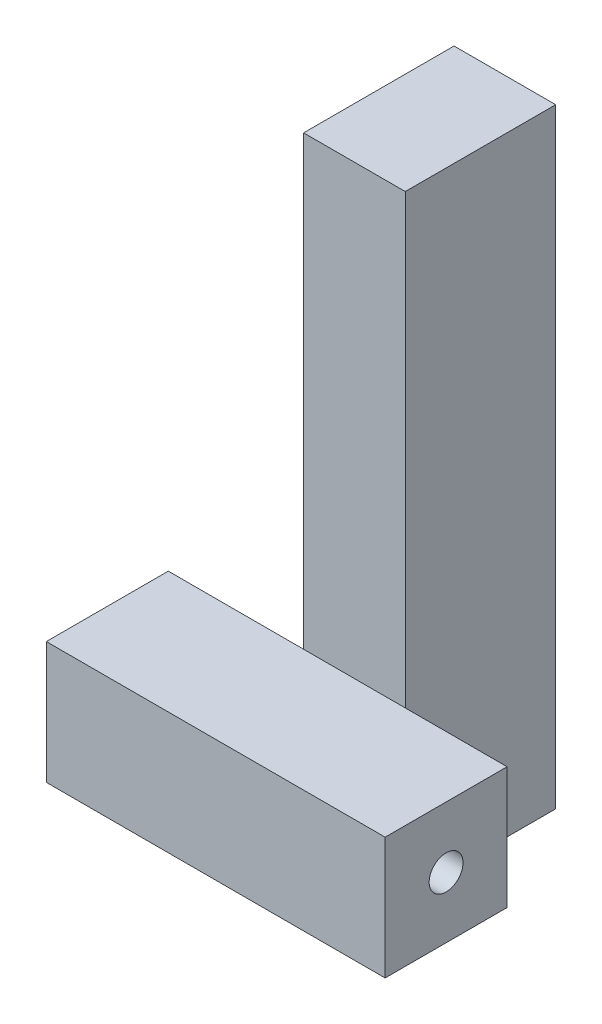
ISO-10303-21;
HEADER;
FILE_DESCRIPTION(('STEP AP214'),'2;1');
FILE_NAME('part.step','',(''),(''),'','','');
FILE_SCHEMA(('AUTOMOTIVE_DESIGN { 1 0 10303 214 1 1 1 1 }'));
ENDSEC;
DATA;
#1=APPLICATION_CONTEXT('core data for automotive mechanical design processes');
#2=APPLICATION_PROTOCOL_DEFINITION('international standard','automotive_design',2000,#1);
#3=PRODUCT_CONTEXT('',#1,'mechanical');
#4=PRODUCT('Part','Part','',(#3));
#5=PRODUCT_RELATED_PRODUCT_CATEGORY('part','',(#4));
#6=PRODUCT_DEFINITION_FORMATION('','',#4);
#7=PRODUCT_DEFINITION_CONTEXT('part definition',#1,'design');
#8=PRODUCT_DEFINITION('design','',#6,#7);
#9=PRODUCT_DEFINITION_SHAPE('','',#8);
#10=(LENGTH_UNIT() NAMED_UNIT(*) SI_UNIT(.MILLI.,.METRE.));
#11=(NAMED_UNIT(*) PLANE_ANGLE_UNIT() SI_UNIT($,.RADIAN.));
#12=(NAMED_UNIT(*) SI_UNIT($,.STERADIAN.) SOLID_ANGLE_UNIT());
#13=UNCERTAINTY_MEASURE_WITH_UNIT(LENGTH_MEASURE(1.E-05),#10,'distance_accuracy_value','');
#14=(GEOMETRIC_REPRESENTATION_CONTEXT(3) GLOBAL_UNCERTAINTY_ASSIGNED_CONTEXT((#13)) GLOBAL_UNIT_ASSIGNED_CONTEXT((#10,
#11,#12)) REPRESENTATION_CONTEXT('',''));
#15=CARTESIAN_POINT('',(0.,0.,0.));
#16=DIRECTION('',(0.,0.,1.));
#17=DIRECTION('',(1.,0.,0.));
#18=AXIS2_PLACEMENT_3D('',#15,#16,#17);
#19=CARTESIAN_POINT('',(0.,0.,0.));
#20=DIRECTION('',(0.,0.,1.));
#21=DIRECTION('',(1.,0.,0.));
#22=AXIS2_PLACEMENT_3D('',#19,#20,#21);
#23=PLANE('',#22);
#24=DIRECTION('',(0.,1.,0.));
#25=VECTOR('',#24,1.);
#26=CARTESIAN_POINT('',(-12.7738495112353,-38.1,0.));
#27=LINE('',#26,#25);
#28=CARTESIAN_POINT('',(-12.7738495112353,-22.86,0.));
#29=VERTEX_POINT('',#28);
#30=CARTESIAN_POINT('',(-12.7738495112353,22.86,0.));
#31=VERTEX_POINT('',#30);
#32=EDGE_CURVE('E13',#29,#31,#27,.T.);
#33=ORIENTED_EDGE('',*,*,#32,.F.);
#34=DIRECTION('',(1.,0.,0.));
#35=VECTOR('',#34,1.);
#36=CARTESIAN_POINT('',(-63.5,-22.86,0.));
#37=LINE('',#36,#35);
#38=CARTESIAN_POINT('',(-63.5,-22.86,0.));
#39=VERTEX_POINT('',#38);
#40=EDGE_CURVE('E165',#39,#29,#37,.T.);
#41=ORIENTED_EDGE('',*,*,#40,.F.);
#42=DIRECTION('',(0.,-1.,0.));
#43=VECTOR('',#42,1.);
#44=CARTESIAN_POINT('',(-63.5,22.86,0.));
#45=LINE('',#44,#43);
#46=CARTESIAN_POINT('',(-63.5,22.86,0.));
#47=VERTEX_POINT('',#46);
#48=EDGE_CURVE('E174',#47,#39,#45,.T.);
#49=ORIENTED_EDGE('',*,*,#48,.F.);
#50=DIRECTION('',(-1.,0.,0.));
#51=VECTOR('',#50,1.);
#52=CARTESIAN_POINT('',(-63.5,22.86,0.));
#53=LINE('',#52,#51);
#54=EDGE_CURVE('E66',#31,#47,#53,.T.);
#55=ORIENTED_EDGE('',*,*,#54,.F.);
#56=EDGE_LOOP('',(#33,#41,#49,#55));
#57=FACE_BOUND('',#56,.T.);
#58=ADVANCED_FACE('F47',(#57),#23,.F.);
#59=DIRECTION('',(0.,-1.,0.));
#60=VECTOR('',#59,1.);
#61=CARTESIAN_POINT('',(25.3261504887647,-38.1,0.));
#62=LINE('',#61,#60);
#63=CARTESIAN_POINT('',(25.3261504887647,22.86,0.));
#64=VERTEX_POINT('',#63);
#65=CARTESIAN_POINT('',(25.3261504887647,-22.86,0.));
#66=VERTEX_POINT('',#65);
#67=EDGE_CURVE('E56',#64,#66,#62,.T.);
#68=ORIENTED_EDGE('',*,*,#67,.F.);
#69=CARTESIAN_POINT('',(63.5,22.86,0.));
#70=VERTEX_POINT('',#69);
#71=EDGE_CURVE('E172',#70,#64,#53,.T.);
#72=ORIENTED_EDGE('',*,*,#71,.F.);
#73=DIRECTION('',(0.,1.,0.));
#74=VECTOR('',#73,1.);
#75=CARTESIAN_POINT('',(63.5,22.86,0.));
#76=LINE('',#75,#74);
#77=CARTESIAN_POINT('',(63.5,-22.86,0.));
#78=VERTEX_POINT('',#77);
#79=EDGE_CURVE('E153',#78,#70,#76,.T.);
#80=ORIENTED_EDGE('',*,*,#79,.F.);
#81=EDGE_CURVE('E177',#66,#78,#37,.T.);
#82=ORIENTED_EDGE('',*,*,#81,.F.);
#83=EDGE_LOOP('',(#68,#72,#80,#82));
#84=FACE_BOUND('',#83,.T.);
#85=ADVANCED_FACE('F248',(#84),#23,.F.);
#86=CARTESIAN_POINT('',(63.5,22.86,45.72));
#87=DIRECTION('',(-1.,0.,0.));
#88=DIRECTION('',(0.,0.,1.));
#89=AXIS2_PLACEMENT_3D('',#86,#87,#88);
#90=PLANE('',#89);
#91=CARTESIAN_POINT('',(63.5,0.,22.86));
#92=DIRECTION('',(1.,0.,0.));
#93=DIRECTION('',(0.,0.,-1.));
#94=AXIS2_PLACEMENT_3D('',#91,#92,#93);
#95=CIRCLE('',#94,6.35);
#96=CARTESIAN_POINT('',(63.5,0.,16.51));
#97=VERTEX_POINT('',#96);
#98=EDGE_CURVE('E208',#97,#97,#95,.T.);
#99=ORIENTED_EDGE('',*,*,#98,.F.);
#100=EDGE_LOOP('',(#99));
#101=FACE_BOUND('',#100,.T.);
#102=ORIENTED_EDGE('',*,*,#79,.T.);
#103=DIRECTION('',(0.,0.,-1.));
#104=VECTOR('',#103,1.);
#105=CARTESIAN_POINT('',(63.5,22.86,45.72));
#106=LINE('',#105,#104);
#107=CARTESIAN_POINT('',(63.5,22.86,45.72));
#108=VERTEX_POINT('',#107);
#109=EDGE_CURVE('E51',#108,#70,#106,.T.);
#110=ORIENTED_EDGE('',*,*,#109,.F.);
#111=DIRECTION('',(0.,1.,0.));
#112=VECTOR('',#111,1.);
#113=CARTESIAN_POINT('',(63.5,22.86,45.72));
#114=LINE('',#113,#112);
#115=CARTESIAN_POINT('',(63.5,-22.86,45.72));
#116=VERTEX_POINT('',#115);
#117=EDGE_CURVE('E161',#116,#108,#114,.T.);
#118=ORIENTED_EDGE('',*,*,#117,.F.);
#119=DIRECTION('',(0.,0.,-1.));
#120=VECTOR('',#119,1.);
#121=CARTESIAN_POINT('',(63.5,-22.86,45.72));
#122=LINE('',#121,#120);
#123=EDGE_CURVE('E170',#116,#78,#122,.T.);
#124=ORIENTED_EDGE('',*,*,#123,.T.);
#125=EDGE_LOOP('',(#102,#110,#118,#124));
#126=FACE_BOUND('',#125,.T.);
#127=ADVANCED_FACE('F49',(#101,#126),#90,.F.);
#128=CARTESIAN_POINT('',(-63.5,22.86,45.72));
#129=DIRECTION('',(0.,-1.,0.));
#130=DIRECTION('',(0.,0.,-1.));
#131=AXIS2_PLACEMENT_3D('',#128,#129,#130);
#132=PLANE('',#131);
#133=ORIENTED_EDGE('',*,*,#71,.T.);
#134=EDGE_CURVE('E175',#64,#31,#53,.T.);
#135=ORIENTED_EDGE('',*,*,#134,.T.);
#136=ORIENTED_EDGE('',*,*,#54,.T.);
#137=DIRECTION('',(0.,0.,-1.));
#138=VECTOR('',#137,1.);
#139=CARTESIAN_POINT('',(-63.5,22.86,45.72));
#140=LINE('',#139,#138);
#141=CARTESIAN_POINT('',(-63.5,22.86,45.72));
#142=VERTEX_POINT('',#141);
#143=EDGE_CURVE('E185',#142,#47,#140,.T.);
#144=ORIENTED_EDGE('',*,*,#143,.F.);
#145=DIRECTION('',(-1.,0.,0.));
#146=VECTOR('',#145,1.);
#147=CARTESIAN_POINT('',(-63.5,22.86,45.72));
#148=LINE('',#147,#146);
#149=EDGE_CURVE('E164',#108,#142,#148,.T.);
#150=ORIENTED_EDGE('',*,*,#149,.F.);
#151=ORIENTED_EDGE('',*,*,#109,.T.);
#152=EDGE_LOOP('',(#133,#135,#136,#144,#150,#151));
#153=FACE_BOUND('',#152,.T.);
#154=ADVANCED_FACE('F233',(#153),#132,.F.);
#155=CARTESIAN_POINT('',(-63.5,22.86,45.72));
#156=DIRECTION('',(1.,0.,0.));
#157=DIRECTION('',(0.,0.,-1.));
#158=AXIS2_PLACEMENT_3D('',#155,#156,#157);
#159=PLANE('',#158);
#160=CARTESIAN_POINT('',(-63.5,0.,22.86));
#161=DIRECTION('',(-1.,0.,0.));
#162=DIRECTION('',(0.,0.,1.));
#163=AXIS2_PLACEMENT_3D('',#160,#161,#162);
#164=CIRCLE('',#163,6.35);
#165=CARTESIAN_POINT('',(-63.5,0.,29.21));
#166=VERTEX_POINT('',#165);
#167=EDGE_CURVE('E215',#166,#166,#164,.T.);
#168=ORIENTED_EDGE('',*,*,#167,.F.);
#169=EDGE_LOOP('',(#168));
#170=FACE_BOUND('',#169,.T.);
#171=ORIENTED_EDGE('',*,*,#48,.T.);
#172=DIRECTION('',(0.,0.,-1.));
#173=VECTOR('',#172,1.);
#174=CARTESIAN_POINT('',(-63.5,-22.86,45.72));
#175=LINE('',#174,#173);
#176=CARTESIAN_POINT('',(-63.5,-22.86,45.72));
#177=VERTEX_POINT('',#176);
#178=EDGE_CURVE('E183',#177,#39,#175,.T.);
#179=ORIENTED_EDGE('',*,*,#178,.F.);
#180=DIRECTION('',(0.,-1.,0.));
#181=VECTOR('',#180,1.);
#182=CARTESIAN_POINT('',(-63.5,22.86,45.72));
#183=LINE('',#182,#181);
#184=EDGE_CURVE('E167',#142,#177,#183,.T.);
#185=ORIENTED_EDGE('',*,*,#184,.F.);
#186=ORIENTED_EDGE('',*,*,#143,.T.);
#187=EDGE_LOOP('',(#171,#179,#185,#186));
#188=FACE_BOUND('',#187,.T.);
#189=ADVANCED_FACE('F230',(#170,#188),#159,.F.);
#190=CARTESIAN_POINT('',(-63.5,-22.86,45.72));
#191=DIRECTION('',(0.,1.,0.));
#192=DIRECTION('',(0.,0.,1.));
#193=AXIS2_PLACEMENT_3D('',#190,#191,#192);
#194=PLANE('',#193);
#195=ORIENTED_EDGE('',*,*,#40,.T.);
#196=EDGE_CURVE('E180',#29,#66,#37,.T.);
#197=ORIENTED_EDGE('',*,*,#196,.T.);
#198=ORIENTED_EDGE('',*,*,#81,.T.);
#199=ORIENTED_EDGE('',*,*,#123,.F.);
#200=DIRECTION('',(1.,0.,0.));
#201=VECTOR('',#200,1.);
#202=CARTESIAN_POINT('',(-63.5,-22.86,45.72));
#203=LINE('',#202,#201);
#204=EDGE_CURVE('E169',#177,#116,#203,.T.);
#205=ORIENTED_EDGE('',*,*,#204,.F.);
#206=ORIENTED_EDGE('',*,*,#178,.T.);
#207=EDGE_LOOP('',(#195,#197,#198,#199,#205,#206));
#208=FACE_BOUND('',#207,.T.);
#209=ADVANCED_FACE('F232',(#208),#194,.F.);
#210=CARTESIAN_POINT('',(0.,0.,45.72));
#211=DIRECTION('',(0.,0.,1.));
#212=DIRECTION('',(1.,0.,0.));
#213=AXIS2_PLACEMENT_3D('',#210,#211,#212);
#214=PLANE('',#213);
#215=ORIENTED_EDGE('',*,*,#117,.T.);
#216=ORIENTED_EDGE('',*,*,#149,.T.);
#217=ORIENTED_EDGE('',*,*,#184,.T.);
#218=ORIENTED_EDGE('',*,*,#204,.T.);
#219=EDGE_LOOP('',(#215,#216,#217,#218));
#220=FACE_BOUND('',#219,.T.);
#221=ADVANCED_FACE('F273',(#220),#214,.T.);
#222=CARTESIAN_POINT('',(0.,0.,0.));
#223=DIRECTION('',(0.,0.,-1.));
#224=DIRECTION('',(-1.,0.,0.));
#225=AXIS2_PLACEMENT_3D('',#222,#223,#224);
#226=PLANE('',#225);
#227=ORIENTED_EDGE('',*,*,#196,.F.);
#228=CARTESIAN_POINT('',(-12.7738495112353,-38.1,0.));
#229=VERTEX_POINT('',#228);
#230=EDGE_CURVE('E58',#229,#29,#27,.T.);
#231=ORIENTED_EDGE('',*,*,#230,.F.);
#232=DIRECTION('',(-1.,0.,0.));
#233=VECTOR('',#232,1.);
#234=CARTESIAN_POINT('',(-12.7738495112353,-38.1,0.));
#235=LINE('',#234,#233);
#236=CARTESIAN_POINT('',(25.3261504887647,-38.1,0.));
#237=VERTEX_POINT('',#236);
#238=EDGE_CURVE('E147',#237,#229,#235,.T.);
#239=ORIENTED_EDGE('',*,*,#238,.F.);
#240=EDGE_CURVE('E195',#66,#237,#62,.T.);
#241=ORIENTED_EDGE('',*,*,#240,.F.);
#242=EDGE_LOOP('',(#227,#231,#239,#241));
#243=FACE_BOUND('',#242,.T.);
#244=ADVANCED_FACE('F244',(#243),#226,.F.);
#245=CARTESIAN_POINT('',(-12.7738495112353,-38.1,-56.388));
#246=DIRECTION('',(1.,0.,0.));
#247=DIRECTION('',(0.,0.,-1.));
#248=AXIS2_PLACEMENT_3D('',#245,#246,#247);
#249=PLANE('',#248);
#250=ORIENTED_EDGE('',*,*,#230,.T.);
#251=ORIENTED_EDGE('',*,*,#32,.T.);
#252=CARTESIAN_POINT('',(-12.7738495112353,190.5,0.));
#253=VERTEX_POINT('',#252);
#254=EDGE_CURVE('E59',#31,#253,#27,.T.);
#255=ORIENTED_EDGE('',*,*,#254,.T.);
#256=DIRECTION('',(0.,0.,1.));
#257=VECTOR('',#256,1.);
#258=CARTESIAN_POINT('',(-12.7738495112353,190.5,-56.388));
#259=LINE('',#258,#257);
#260=CARTESIAN_POINT('',(-12.7738495112353,190.5,-56.388));
#261=VERTEX_POINT('',#260);
#262=EDGE_CURVE('E132',#261,#253,#259,.T.);
#263=ORIENTED_EDGE('',*,*,#262,.F.);
#264=DIRECTION('',(0.,1.,0.));
#265=VECTOR('',#264,1.);
#266=CARTESIAN_POINT('',(-12.7738495112353,-38.1,-56.388));
#267=LINE('',#266,#265);
#268=CARTESIAN_POINT('',(-12.7738495112353,-38.1,-56.388));
#269=VERTEX_POINT('',#268);
#270=EDGE_CURVE('E138',#269,#261,#267,.T.);
#271=ORIENTED_EDGE('',*,*,#270,.F.);
#272=DIRECTION('',(0.,0.,1.));
#273=VECTOR('',#272,1.);
#274=CARTESIAN_POINT('',(-12.7738495112353,-38.1,-56.388));
#275=LINE('',#274,#273);
#276=EDGE_CURVE('E206',#269,#229,#275,.T.);
#277=ORIENTED_EDGE('',*,*,#276,.T.);
#278=EDGE_LOOP('',(#250,#251,#255,#263,#271,#277));
#279=FACE_BOUND('',#278,.T.);
#280=ADVANCED_FACE('F150',(#279),#249,.F.);
#281=CARTESIAN_POINT('',(-12.7738495112353,190.5,-56.388));
#282=DIRECTION('',(0.,-1.,0.));
#283=DIRECTION('',(0.,0.,-1.));
#284=AXIS2_PLACEMENT_3D('',#281,#282,#283);
#285=PLANE('',#284);
#286=DIRECTION('',(1.,0.,0.));
#287=VECTOR('',#286,1.);
#288=CARTESIAN_POINT('',(-12.7738495112353,190.5,0.));
#289=LINE('',#288,#287);
#290=CARTESIAN_POINT('',(25.3261504887647,190.5,0.));
#291=VERTEX_POINT('',#290);
#292=EDGE_CURVE('E200',#253,#291,#289,.T.);
#293=ORIENTED_EDGE('',*,*,#292,.T.);
#294=DIRECTION('',(0.,0.,1.));
#295=VECTOR('',#294,1.);
#296=CARTESIAN_POINT('',(25.3261504887647,190.5,-56.388));
#297=LINE('',#296,#295);
#298=CARTESIAN_POINT('',(25.3261504887647,190.5,-56.388));
#299=VERTEX_POINT('',#298);
#300=EDGE_CURVE('E134',#299,#291,#297,.T.);
#301=ORIENTED_EDGE('',*,*,#300,.F.);
#302=DIRECTION('',(1.,0.,0.));
#303=VECTOR('',#302,1.);
#304=CARTESIAN_POINT('',(-12.7738495112353,190.5,-56.388));
#305=LINE('',#304,#303);
#306=EDGE_CURVE('E128',#261,#299,#305,.T.);
#307=ORIENTED_EDGE('',*,*,#306,.F.);
#308=ORIENTED_EDGE('',*,*,#262,.T.);
#309=EDGE_LOOP('',(#293,#301,#307,#308));
#310=FACE_BOUND('',#309,.T.);
#311=ADVANCED_FACE('F130',(#310),#285,.F.);
#312=CARTESIAN_POINT('',(25.3261504887647,-38.1,-56.388));
#313=DIRECTION('',(-1.,0.,0.));
#314=DIRECTION('',(0.,0.,1.));
#315=AXIS2_PLACEMENT_3D('',#312,#313,#314);
#316=PLANE('',#315);
#317=EDGE_CURVE('E194',#291,#64,#62,.T.);
#318=ORIENTED_EDGE('',*,*,#317,.T.);
#319=ORIENTED_EDGE('',*,*,#67,.T.);
#320=ORIENTED_EDGE('',*,*,#240,.T.);
#321=DIRECTION('',(0.,0.,1.));
#322=VECTOR('',#321,1.);
#323=CARTESIAN_POINT('',(25.3261504887647,-38.1,-56.388));
#324=LINE('',#323,#322);
#325=CARTESIAN_POINT('',(25.3261504887647,-38.1,-56.388));
#326=VERTEX_POINT('',#325);
#327=EDGE_CURVE('E157',#326,#237,#324,.T.);
#328=ORIENTED_EDGE('',*,*,#327,.F.);
#329=DIRECTION('',(0.,-1.,0.));
#330=VECTOR('',#329,1.);
#331=CARTESIAN_POINT('',(25.3261504887647,-38.1,-56.388));
#332=LINE('',#331,#330);
#333=EDGE_CURVE('E137',#299,#326,#332,.T.);
#334=ORIENTED_EDGE('',*,*,#333,.F.);
#335=ORIENTED_EDGE('',*,*,#300,.T.);
#336=EDGE_LOOP('',(#318,#319,#320,#328,#334,#335));
#337=FACE_BOUND('',#336,.T.);
#338=ADVANCED_FACE('F253',(#337),#316,.F.);
#339=CARTESIAN_POINT('',(-12.7738495112353,-38.1,-56.388));
#340=DIRECTION('',(0.,1.,0.));
#341=DIRECTION('',(-1.,0.,0.));
#342=AXIS2_PLACEMENT_3D('',#339,#340,#341);
#343=PLANE('',#342);
#344=ORIENTED_EDGE('',*,*,#238,.T.);
#345=ORIENTED_EDGE('',*,*,#276,.F.);
#346=DIRECTION('',(-1.,0.,0.));
#347=VECTOR('',#346,1.);
#348=CARTESIAN_POINT('',(-12.7738495112353,-38.1,-56.388));
#349=LINE('',#348,#347);
#350=EDGE_CURVE('E143',#326,#269,#349,.T.);
#351=ORIENTED_EDGE('',*,*,#350,.F.);
#352=ORIENTED_EDGE('',*,*,#327,.T.);
#353=EDGE_LOOP('',(#344,#345,#351,#352));
#354=FACE_BOUND('',#353,.T.);
#355=ADVANCED_FACE('F255',(#354),#343,.F.);
#356=CARTESIAN_POINT('',(0.,0.,-56.388));
#357=DIRECTION('',(0.,0.,-1.));
#358=DIRECTION('',(-1.,0.,0.));
#359=AXIS2_PLACEMENT_3D('',#356,#357,#358);
#360=PLANE('',#359);
#361=ORIENTED_EDGE('',*,*,#270,.T.);
#362=ORIENTED_EDGE('',*,*,#306,.T.);
#363=ORIENTED_EDGE('',*,*,#333,.T.);
#364=ORIENTED_EDGE('',*,*,#350,.T.);
#365=EDGE_LOOP('',(#361,#362,#363,#364));
#366=FACE_BOUND('',#365,.T.);
#367=ADVANCED_FACE('F141',(#366),#360,.T.);
#368=ORIENTED_EDGE('',*,*,#134,.F.);
#369=ORIENTED_EDGE('',*,*,#317,.F.);
#370=ORIENTED_EDGE('',*,*,#292,.F.);
#371=ORIENTED_EDGE('',*,*,#254,.F.);
#372=EDGE_LOOP('',(#368,#369,#370,#371));
#373=FACE_BOUND('',#372,.T.);
#374=ADVANCED_FACE('F252',(#373),#226,.F.);
#375=CARTESIAN_POINT('',(48.26,0.,22.86));
#376=DIRECTION('',(1.,0.,0.));
#377=DIRECTION('',(0.,0.,-1.));
#378=AXIS2_PLACEMENT_3D('',#375,#376,#377);
#379=CYLINDRICAL_SURFACE('',#378,6.35);
#380=CARTESIAN_POINT('',(48.26,0.,22.86));
#381=DIRECTION('',(1.,0.,0.));
#382=DIRECTION('',(0.,0.,-1.));
#383=AXIS2_PLACEMENT_3D('',#380,#381,#382);
#384=CIRCLE('',#383,6.35);
#385=CARTESIAN_POINT('',(48.26,0.,16.51));
#386=VERTEX_POINT('',#385);
#387=EDGE_CURVE('E211',#386,#386,#384,.T.);
#388=ORIENTED_EDGE('',*,*,#387,.F.);
#389=EDGE_LOOP('',(#388));
#390=FACE_BOUND('',#389,.T.);
#391=ORIENTED_EDGE('',*,*,#98,.T.);
#392=EDGE_LOOP('',(#391));
#393=FACE_BOUND('',#392,.T.);
#394=ADVANCED_FACE('F285',(#390,#393),#379,.F.);
#395=CARTESIAN_POINT('',(48.26,0.,22.86));
#396=DIRECTION('',(1.,0.,0.));
#397=DIRECTION('',(0.,0.,-1.));
#398=AXIS2_PLACEMENT_3D('',#395,#396,#397);
#399=PLANE('',#398);
#400=ORIENTED_EDGE('',*,*,#387,.T.);
#401=EDGE_LOOP('',(#400));
#402=FACE_BOUND('',#401,.T.);
#403=ADVANCED_FACE('F226',(#402),#399,.T.);
#404=CARTESIAN_POINT('',(-48.26,0.,22.86));
#405=DIRECTION('',(-1.,0.,0.));
#406=DIRECTION('',(0.,0.,1.));
#407=AXIS2_PLACEMENT_3D('',#404,#405,#406);
#408=CYLINDRICAL_SURFACE('',#407,6.35);
#409=CARTESIAN_POINT('',(-48.26,0.,22.86));
#410=DIRECTION('',(-1.,0.,0.));
#411=DIRECTION('',(0.,0.,1.));
#412=AXIS2_PLACEMENT_3D('',#409,#410,#411);
#413=CIRCLE('',#412,6.35);
#414=CARTESIAN_POINT('',(-48.26,0.,29.21));
#415=VERTEX_POINT('',#414);
#416=EDGE_CURVE('E212',#415,#415,#413,.T.);
#417=ORIENTED_EDGE('',*,*,#416,.F.);
#418=EDGE_LOOP('',(#417));
#419=FACE_BOUND('',#418,.T.);
#420=ORIENTED_EDGE('',*,*,#167,.T.);
#421=EDGE_LOOP('',(#420));
#422=FACE_BOUND('',#421,.T.);
#423=ADVANCED_FACE('F223',(#419,#422),#408,.F.);
#424=CARTESIAN_POINT('',(-48.26,0.,22.86));
#425=DIRECTION('',(-1.,0.,0.));
#426=DIRECTION('',(0.,0.,1.));
#427=AXIS2_PLACEMENT_3D('',#424,#425,#426);
#428=PLANE('',#427);
#429=ORIENTED_EDGE('',*,*,#416,.T.);
#430=EDGE_LOOP('',(#429));
#431=FACE_BOUND('',#430,.T.);
#432=ADVANCED_FACE('F221',(#431),#428,.T.);
#433=CLOSED_SHELL('',(#58,#85,#127,#154,#189,#209,#221,#244,#280,#311,#338,#355,#367,#374,#394,
#403,#423,#432));
#434=MANIFOLD_SOLID_BREP('B2',#433);
#435=ADVANCED_BREP_SHAPE_REPRESENTATION('',(#18,#434),#14);
#436=SHAPE_DEFINITION_REPRESENTATION(#9,#435);
ENDSEC;
END-ISO-10303-21;
